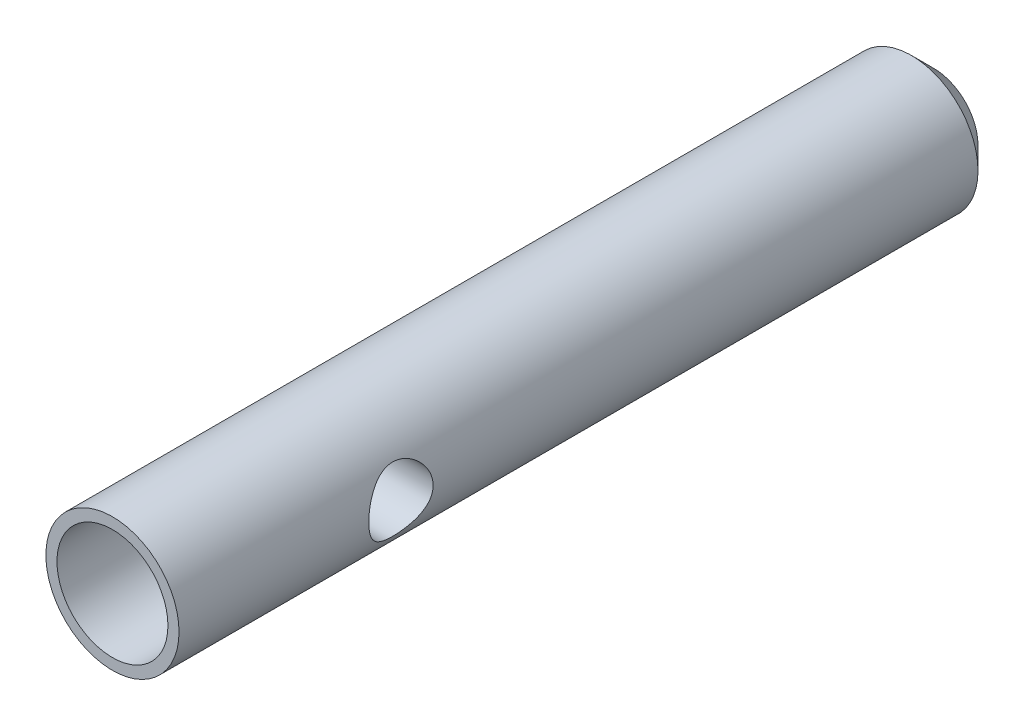
ISO-10303-21;
HEADER;
FILE_DESCRIPTION(('STEP AP214'),'2;1');
FILE_NAME('part.step','',(''),(''),'','','');
FILE_SCHEMA(('AUTOMOTIVE_DESIGN { 1 0 10303 214 1 1 1 1 }'));
ENDSEC;
DATA;
#1=APPLICATION_CONTEXT('core data for automotive mechanical design processes');
#2=APPLICATION_PROTOCOL_DEFINITION('international standard','automotive_design',2000,#1);
#3=PRODUCT_CONTEXT('',#1,'mechanical');
#4=PRODUCT('Part','Part','',(#3));
#5=PRODUCT_RELATED_PRODUCT_CATEGORY('part','',(#4));
#6=PRODUCT_DEFINITION_FORMATION('','',#4);
#7=PRODUCT_DEFINITION_CONTEXT('part definition',#1,'design');
#8=PRODUCT_DEFINITION('design','',#6,#7);
#9=PRODUCT_DEFINITION_SHAPE('','',#8);
#10=(LENGTH_UNIT() NAMED_UNIT(*) SI_UNIT(.MILLI.,.METRE.));
#11=(NAMED_UNIT(*) PLANE_ANGLE_UNIT() SI_UNIT($,.RADIAN.));
#12=(NAMED_UNIT(*) SI_UNIT($,.STERADIAN.) SOLID_ANGLE_UNIT());
#13=UNCERTAINTY_MEASURE_WITH_UNIT(LENGTH_MEASURE(1.E-05),#10,'distance_accuracy_value','');
#14=(GEOMETRIC_REPRESENTATION_CONTEXT(3) GLOBAL_UNCERTAINTY_ASSIGNED_CONTEXT((#13)) GLOBAL_UNIT_ASSIGNED_CONTEXT((#10,
#11,#12)) REPRESENTATION_CONTEXT('',''));
#15=CARTESIAN_POINT('',(0.,0.,0.));
#16=DIRECTION('',(0.,0.,1.));
#17=DIRECTION('',(1.,0.,0.));
#18=AXIS2_PLACEMENT_3D('',#15,#16,#17);
#19=CARTESIAN_POINT('',(0.,0.,37.));
#20=DIRECTION('',(0.,0.,-1.));
#21=DIRECTION('',(-1.,0.,0.));
#22=AXIS2_PLACEMENT_3D('',#19,#20,#21);
#23=CYLINDRICAL_SURFACE('',#22,3.);
#24=CARTESIAN_POINT('',(-3.,0.,25.55));
#25=CARTESIAN_POINT('',(-2.99999612081298,0.0765307274979416,25.5500045405193));
#26=CARTESIAN_POINT('',(-2.99703967394009,0.153161642735378,25.5560945879909));
#27=CARTESIAN_POINT('',(-2.98550501152449,0.304177604644465,25.5801943768202));
#28=CARTESIAN_POINT('',(-2.97691520396142,0.378557688801597,25.5982286972059));
#29=CARTESIAN_POINT('',(-2.9550169031266,0.52265346658165,25.6453572298512));
#30=CARTESIAN_POINT('',(-2.94172634014956,0.592385703895517,25.6744094460817));
#31=CARTESIAN_POINT('',(-2.91166102341307,0.725892100939563,25.7425412652125));
#32=CARTESIAN_POINT('',(-2.89488669768938,0.789666991230455,25.7816196363786));
#33=CARTESIAN_POINT('',(-2.85828185236896,0.913584245144568,25.8712643449592));
#34=CARTESIAN_POINT('',(-2.83833092337698,0.973305533119433,25.9223628970886));
#35=CARTESIAN_POINT('',(-2.79803945446581,1.0837139061515,26.0334573078884));
#36=CARTESIAN_POINT('',(-2.77769864962032,1.13439458820743,26.0934594178325));
#37=CARTESIAN_POINT('',(-2.73727073702847,1.22889240144532,26.2257950833783));
#38=CARTESIAN_POINT('',(-2.7173048647613,1.27196367592979,26.2987025278169));
#39=CARTESIAN_POINT('',(-2.68188338301647,1.34505108316872,26.4518040681357));
#40=CARTESIAN_POINT('',(-2.66642471915123,1.37507606376593,26.5319931809142));
#41=CARTESIAN_POINT('',(-2.64311522038543,1.41934460077888,26.6926111652423));
#42=CARTESIAN_POINT('',(-2.63487517137381,1.43440239745371,26.7727564353587));
#43=CARTESIAN_POINT('',(-2.62587653771564,1.45081708073883,26.9348250536738));
#44=CARTESIAN_POINT('',(-2.625111392162,1.45218598245471,27.0167467793141));
#45=CARTESIAN_POINT('',(-2.63083206405466,1.44178396367734,27.1703772023389));
#46=CARTESIAN_POINT('',(-2.63653015218159,1.43144073903634,27.2422187611512));
#47=CARTESIAN_POINT('',(-2.65316520459532,1.40036487654895,27.3829827717398));
#48=CARTESIAN_POINT('',(-2.66410366451324,1.37962927258196,27.4519043840311));
#49=CARTESIAN_POINT('',(-2.69023571019652,1.32796190942694,27.5868222160692));
#50=CARTESIAN_POINT('',(-2.70552247128007,1.2968039127114,27.6527129076692));
#51=CARTESIAN_POINT('',(-2.73862686619464,1.22534556534202,27.7786368102176));
#52=CARTESIAN_POINT('',(-2.75644562509711,1.18504114577511,27.8386673971671));
#53=CARTESIAN_POINT('',(-2.79513932815918,1.0909059718213,27.9585904788013));
#54=CARTESIAN_POINT('',(-2.81612741275565,1.03604250149277,28.0176385665667));
#55=CARTESIAN_POINT('',(-2.85708426031966,0.917075343074329,28.1260336767916));
#56=CARTESIAN_POINT('',(-2.87705259314359,0.852967798611948,28.1753766301267));
#57=CARTESIAN_POINT('',(-2.91471885551593,0.714000963992316,28.2648322378198));
#58=CARTESIAN_POINT('',(-2.93229107655916,0.638809950962981,28.3044867153606));
#59=CARTESIAN_POINT('',(-2.96214084082005,0.48175794107364,28.3702707725635));
#60=CARTESIAN_POINT('',(-2.97442232399267,0.39990196174367,28.3964104194871));
#61=CARTESIAN_POINT('',(-2.99149074518219,0.238788194513551,28.4323915821561));
#62=CARTESIAN_POINT('',(-2.99679351595986,0.159836780687537,28.4433584162994));
#63=CARTESIAN_POINT('',(-3.00104912370166,0.00104727212449658,28.4521754425244));
#64=CARTESIAN_POINT('',(-3.00000468355028,-0.0787904277354053,28.4500312590876));
#65=CARTESIAN_POINT('',(-2.99199281350272,-0.231041699195564,28.4333755874306));
#66=CARTESIAN_POINT('',(-2.98545325282241,-0.303578577529127,28.4197573111068));
#67=CARTESIAN_POINT('',(-2.96764024286646,-0.445205658807543,28.381906867184));
#68=CARTESIAN_POINT('',(-2.95636625577126,-0.514295469175788,28.3576734937218));
#69=CARTESIAN_POINT('',(-2.92969647172705,-0.649435554841712,28.2985898512282));
#70=CARTESIAN_POINT('',(-2.91418782119759,-0.715333824030334,28.2634446247957));
#71=CARTESIAN_POINT('',(-2.88057742037419,-0.840524717425349,28.1838608738915));
#72=CARTESIAN_POINT('',(-2.86247454151105,-0.899814446652079,28.1394183008984));
#73=CARTESIAN_POINT('',(-2.8234626779216,-1.01594845859459,28.0377127332999));
#74=CARTESIAN_POINT('',(-2.80244935025403,-1.07205124593029,27.9796413939304));
#75=CARTESIAN_POINT('',(-2.76128527675647,-1.17402466981411,27.8547912119017));
#76=CARTESIAN_POINT('',(-2.74113503731897,-1.2198893641481,27.7880073479128));
#77=CARTESIAN_POINT('',(-2.70323844091546,-1.301776942757,27.6441969618619));
#78=CARTESIAN_POINT('',(-2.68562066156143,-1.3373321590834,27.5668673658673));
#79=CARTESIAN_POINT('',(-2.65636772005657,-1.39454633181697,27.4061896500969));
#80=CARTESIAN_POINT('',(-2.64472537944019,-1.41622196994996,27.322848889697));
#81=CARTESIAN_POINT('',(-2.63011324701133,-1.44316248444081,27.1608710996561));
#82=CARTESIAN_POINT('',(-2.62643457503468,-1.44977184912152,27.0825224836815));
#83=CARTESIAN_POINT('',(-2.62619039680624,-1.45021623758756,26.925790225));
#84=CARTESIAN_POINT('',(-2.62962241574508,-1.44405570581539,26.847406603969));
#85=CARTESIAN_POINT('',(-2.64248035535494,-1.42037023201846,26.6997084358879));
#86=CARTESIAN_POINT('',(-2.65138127826905,-1.40383826193517,26.6301834859031));
#87=CARTESIAN_POINT('',(-2.6735971949962,-1.36104948582567,26.4949475272367));
#88=CARTESIAN_POINT('',(-2.6869135463913,-1.33478968855853,26.4292376988756));
#89=CARTESIAN_POINT('',(-2.71755592132651,-1.27130208969093,26.2986348909379));
#90=CARTESIAN_POINT('',(-2.73509104726921,-1.23345653697834,26.234092613847));
#91=CARTESIAN_POINT('',(-2.77180093726383,-1.14858894319866,26.1118640567804));
#92=CARTESIAN_POINT('',(-2.79097651389737,-1.10156233942563,26.0541812087646));
#93=CARTESIAN_POINT('',(-2.83134850762111,-0.993550269121284,25.9406828543666));
#94=CARTESIAN_POINT('',(-2.85253372552738,-0.931595972289931,25.8857804055507));
#95=CARTESIAN_POINT('',(-2.89255523527256,-0.798708288939405,25.7869793488573));
#96=CARTESIAN_POINT('',(-2.91139034591478,-0.727770422956243,25.7430862633325));
#97=CARTESIAN_POINT('',(-2.94467865113621,-0.578543437348614,25.667793403571));
#98=CARTESIAN_POINT('',(-2.95913047560339,-0.500252029174533,25.6363975347141));
#99=CARTESIAN_POINT('',(-2.98192539561231,-0.338708874975766,25.5876080840824));
#100=CARTESIAN_POINT('',(-2.99028627815326,-0.25547234610191,25.5701737164844));
#101=CARTESIAN_POINT('',(-2.99673174492225,-0.142893528745381,25.5567726387636));
#102=CARTESIAN_POINT('',(-2.997954546114,-0.114392467424232,25.5542360394183));
#103=CARTESIAN_POINT('',(-2.99958940972665,-0.0572656164332232,25.5508488491782));
#104=CARTESIAN_POINT('',(-3.00000145169445,-0.0286398236350072,25.5499983008175));
#105=CARTESIAN_POINT('',(-3.,0.,25.55));
#106=B_SPLINE_CURVE_WITH_KNOTS('',3,(#24,#25,#26,#27,#28,#29,#30,#31,#32,#33,#34,#35,#36,#37,
#38,#39,#40,#41,#42,#43,#44,#45,#46,#47,#48,#49,#50,#51,#52,#53,#54,#55,#56,#57,#58,#59,#60,#61,
#62,#63,#64,#65,#66,#67,#68,#69,#70,#71,#72,#73,#74,#75,#76,#77,#78,#79,#80,#81,#82,#83,#84,#85,
#86,#87,#88,#89,#90,#91,#92,#93,#94,#95,#96,#97,#98,#99,#100,#101,#102,#103,#104,#105),
.UNSPECIFIED.,.T.,.F.,(4,2,2,2,2,2,2,2,2,2,2,2,2,2,2,2,2,2,2,2,2,2,2,2,2,2,2,2,2,2,2,2,2,2,2,2,
2,2,2,2,4),(0.,0.22947557086318,0.459424831854174,0.688506282141685,0.91755960275651,
1.15981165811999,1.40223461290408,1.66192237223259,1.92143373845101,2.16589509779607,
2.4101418680794,2.62754281740569,2.84500585116379,3.06753398921646,3.29016131673734,
3.53893772322278,3.7878182142308,4.04684255861719,4.30567367553667,4.54403791097849,
4.78229989797434,5.00356397823134,5.22485320036184,5.45273911197755,5.68072446364084,
5.9299339676436,6.17928773952589,6.43862695604369,6.69765388739102,6.9324706888598,
7.16720577826903,7.38231982597292,7.5975000747688,7.82711979689807,8.05685392494063,
8.31201128566552,8.56729637980937,8.82266118802034,9.0772772478384,9.16315091326922,
9.2490267450159),.UNSPECIFIED.);
#107=CARTESIAN_POINT('',(-3.,0.,25.55));
#108=VERTEX_POINT('',#107);
#109=EDGE_CURVE('E10',#108,#108,#106,.T.);
#110=ORIENTED_EDGE('',*,*,#109,.T.);
#111=EDGE_LOOP('',(#110));
#112=FACE_BOUND('',#111,.T.);
#113=CARTESIAN_POINT('',(3.,0.,25.55));
#114=CARTESIAN_POINT('',(2.99999612081298,-0.0765307274979416,25.5500045405193));
#115=CARTESIAN_POINT('',(2.99703967394009,-0.153161642735378,25.5560945879909));
#116=CARTESIAN_POINT('',(2.98550501152449,-0.304177604644465,25.5801943768202));
#117=CARTESIAN_POINT('',(2.97691520396142,-0.378557688801597,25.5982286972059));
#118=CARTESIAN_POINT('',(2.9550169031266,-0.522653466581649,25.6453572298512));
#119=CARTESIAN_POINT('',(2.94172634014957,-0.592385703895515,25.6744094460817));
#120=CARTESIAN_POINT('',(2.91166102341307,-0.725892100939561,25.7425412652125));
#121=CARTESIAN_POINT('',(2.89488669768938,-0.789666991230454,25.7816196363786));
#122=CARTESIAN_POINT('',(2.85828185236896,-0.913584245144567,25.8712643449592));
#123=CARTESIAN_POINT('',(2.83833092337698,-0.973305533119432,25.9223628970886));
#124=CARTESIAN_POINT('',(2.79803945446581,-1.0837139061515,26.0334573078884));
#125=CARTESIAN_POINT('',(2.77769864962032,-1.13439458820743,26.0934594178325));
#126=CARTESIAN_POINT('',(2.73727073702847,-1.22889240144532,26.2257950833783));
#127=CARTESIAN_POINT('',(2.7173048647613,-1.27196367592979,26.2987025278169));
#128=CARTESIAN_POINT('',(2.68188338301647,-1.34505108316872,26.4518040681357));
#129=CARTESIAN_POINT('',(2.66642471915123,-1.37507606376593,26.5319931809142));
#130=CARTESIAN_POINT('',(2.64311522038543,-1.41934460077888,26.6926111652423));
#131=CARTESIAN_POINT('',(2.63487517137381,-1.43440239745371,26.7727564353587));
#132=CARTESIAN_POINT('',(2.62587653771564,-1.45081708073883,26.9348250536738));
#133=CARTESIAN_POINT('',(2.625111392162,-1.45218598245471,27.0167467793141));
#134=CARTESIAN_POINT('',(2.63083206405466,-1.44178396367734,27.1703772023389));
#135=CARTESIAN_POINT('',(2.63653015218159,-1.43144073903634,27.2422187611512));
#136=CARTESIAN_POINT('',(2.65316520459532,-1.40036487654895,27.3829827717398));
#137=CARTESIAN_POINT('',(2.66410366451324,-1.37962927258196,27.4519043840311));
#138=CARTESIAN_POINT('',(2.69023571019652,-1.32796190942694,27.5868222160692));
#139=CARTESIAN_POINT('',(2.70552247128007,-1.2968039127114,27.6527129076692));
#140=CARTESIAN_POINT('',(2.73862686619464,-1.22534556534202,27.7786368102176));
#141=CARTESIAN_POINT('',(2.75644562509711,-1.18504114577511,27.8386673971671));
#142=CARTESIAN_POINT('',(2.79513932815918,-1.0909059718213,27.9585904788013));
#143=CARTESIAN_POINT('',(2.81612741275565,-1.03604250149277,28.0176385665667));
#144=CARTESIAN_POINT('',(2.85708426031966,-0.917075343074328,28.1260336767916));
#145=CARTESIAN_POINT('',(2.87705259314359,-0.852967798611948,28.1753766301267));
#146=CARTESIAN_POINT('',(2.91471885551593,-0.714000963992316,28.2648322378198));
#147=CARTESIAN_POINT('',(2.93229107655916,-0.638809950962981,28.3044867153606));
#148=CARTESIAN_POINT('',(2.96214084082005,-0.48175794107364,28.3702707725635));
#149=CARTESIAN_POINT('',(2.97442232399267,-0.39990196174367,28.3964104194871));
#150=CARTESIAN_POINT('',(2.99149074518219,-0.238788194513552,28.4323915821561));
#151=CARTESIAN_POINT('',(2.99679351595986,-0.159836780687537,28.4433584162994));
#152=CARTESIAN_POINT('',(3.00104912370166,-0.00104727212449696,28.4521754425244));
#153=CARTESIAN_POINT('',(3.00000468355028,0.078790427735405,28.4500312590876));
#154=CARTESIAN_POINT('',(2.99199281350272,0.231041699195563,28.4333755874306));
#155=CARTESIAN_POINT('',(2.98545325282241,0.303578577529127,28.4197573111068));
#156=CARTESIAN_POINT('',(2.96764024286646,0.445205658807543,28.381906867184));
#157=CARTESIAN_POINT('',(2.95636625577126,0.514295469175788,28.3576734937218));
#158=CARTESIAN_POINT('',(2.92969647172705,0.649435554841712,28.2985898512282));
#159=CARTESIAN_POINT('',(2.91418782119759,0.715333824030334,28.2634446247957));
#160=CARTESIAN_POINT('',(2.88057742037419,0.840524717425349,28.1838608738915));
#161=CARTESIAN_POINT('',(2.86247454151105,0.899814446652079,28.1394183008984));
#162=CARTESIAN_POINT('',(2.8234626779216,1.01594845859459,28.0377127332999));
#163=CARTESIAN_POINT('',(2.80244935025403,1.07205124593029,27.9796413939304));
#164=CARTESIAN_POINT('',(2.76128527675647,1.17402466981411,27.8547912119017));
#165=CARTESIAN_POINT('',(2.74113503731897,1.2198893641481,27.7880073479128));
#166=CARTESIAN_POINT('',(2.70323844091546,1.301776942757,27.6441969618619));
#167=CARTESIAN_POINT('',(2.68562066156143,1.3373321590834,27.5668673658673));
#168=CARTESIAN_POINT('',(2.65636772005657,1.39454633181697,27.4061896500969));
#169=CARTESIAN_POINT('',(2.64472537944019,1.41622196994996,27.322848889697));
#170=CARTESIAN_POINT('',(2.63011324701133,1.44316248444081,27.1608710996561));
#171=CARTESIAN_POINT('',(2.62643457503468,1.44977184912152,27.0825224836815));
#172=CARTESIAN_POINT('',(2.62619039680624,1.45021623758756,26.925790225));
#173=CARTESIAN_POINT('',(2.62962241574508,1.44405570581539,26.847406603969));
#174=CARTESIAN_POINT('',(2.64248035535494,1.42037023201846,26.6997084358879));
#175=CARTESIAN_POINT('',(2.65138127826905,1.40383826193517,26.6301834859031));
#176=CARTESIAN_POINT('',(2.6735971949962,1.36104948582567,26.4949475272367));
#177=CARTESIAN_POINT('',(2.6869135463913,1.33478968855853,26.4292376988756));
#178=CARTESIAN_POINT('',(2.71755592132651,1.27130208969093,26.2986348909379));
#179=CARTESIAN_POINT('',(2.73509104726921,1.23345653697834,26.234092613847));
#180=CARTESIAN_POINT('',(2.77180093726383,1.14858894319866,26.1118640567804));
#181=CARTESIAN_POINT('',(2.79097651389737,1.10156233942563,26.0541812087646));
#182=CARTESIAN_POINT('',(2.83134850762111,0.993550269121284,25.9406828543666));
#183=CARTESIAN_POINT('',(2.85253372552738,0.931595972289931,25.8857804055507));
#184=CARTESIAN_POINT('',(2.89255523527256,0.798708288939405,25.7869793488573));
#185=CARTESIAN_POINT('',(2.91139034591478,0.727770422956243,25.7430862633325));
#186=CARTESIAN_POINT('',(2.94467865113621,0.578543437348614,25.667793403571));
#187=CARTESIAN_POINT('',(2.95913047560339,0.500252029174533,25.6363975347141));
#188=CARTESIAN_POINT('',(2.98192539561231,0.338708874975766,25.5876080840824));
#189=CARTESIAN_POINT('',(2.99028627815326,0.25547234610191,25.5701737164844));
#190=CARTESIAN_POINT('',(2.99673174492225,0.142893528745381,25.5567726387636));
#191=CARTESIAN_POINT('',(2.997954546114,0.114392467424232,25.5542360394183));
#192=CARTESIAN_POINT('',(2.99958940972665,0.0572656164332232,25.5508488491782));
#193=CARTESIAN_POINT('',(3.00000145169445,0.0286398236350072,25.5499983008175));
#194=CARTESIAN_POINT('',(3.,0.,25.55));
#195=B_SPLINE_CURVE_WITH_KNOTS('',3,(#113,#114,#115,#116,#117,#118,#119,#120,#121,#122,#123,
#124,#125,#126,#127,#128,#129,#130,#131,#132,#133,#134,#135,#136,#137,#138,#139,#140,#141,#142,
#143,#144,#145,#146,#147,#148,#149,#150,#151,#152,#153,#154,#155,#156,#157,#158,#159,#160,#161,
#162,#163,#164,#165,#166,#167,#168,#169,#170,#171,#172,#173,#174,#175,#176,#177,#178,#179,#180,
#181,#182,#183,#184,#185,#186,#187,#188,#189,#190,#191,#192,#193,#194),.UNSPECIFIED.,.T.,.F.,(4,
2,2,2,2,2,2,2,2,2,2,2,2,2,2,2,2,2,2,2,2,2,2,2,2,2,2,2,2,2,2,2,2,2,2,2,2,2,2,2,4),(0.,
0.22947557086318,0.459424831854174,0.68850628214168,0.91755960275651,1.15981165811999,
1.40223461290408,1.66192237223259,1.92143373845101,2.16589509779607,2.4101418680794,
2.62754281740569,2.84500585116379,3.06753398921646,3.29016131673734,3.53893772322278,
3.7878182142308,4.0468425586172,4.30567367553667,4.54403791097849,4.78229989797434,
5.00356397823134,5.22485320036184,5.45273911197755,5.68072446364084,5.9299339676436,
6.17928773952589,6.43862695604369,6.69765388739102,6.9324706888598,7.16720577826903,
7.38231982597292,7.5975000747688,7.82711979689807,8.05685392494063,8.31201128566552,
8.56729637980937,8.82266118802034,9.0772772478384,9.16315091326922,9.2490267450159),.UNSPECIFIED.);
#196=CARTESIAN_POINT('',(3.,0.,25.55));
#197=VERTEX_POINT('',#196);
#198=EDGE_CURVE('E44',#197,#197,#195,.T.);
#199=ORIENTED_EDGE('',*,*,#198,.T.);
#200=EDGE_LOOP('',(#199));
#201=FACE_BOUND('',#200,.T.);
#202=CARTESIAN_POINT('',(0.,0.,0.999999999999994));
#203=DIRECTION('',(0.,0.,1.));
#204=DIRECTION('',(1.,0.,0.));
#205=AXIS2_PLACEMENT_3D('',#202,#203,#204);
#206=CIRCLE('',#205,3.);
#207=CARTESIAN_POINT('',(3.,0.,0.999999999999994));
#208=VERTEX_POINT('',#207);
#209=EDGE_CURVE('E52',#208,#208,#206,.T.);
#210=ORIENTED_EDGE('',*,*,#209,.T.);
#211=EDGE_LOOP('',(#210));
#212=FACE_BOUND('',#211,.T.);
#213=CARTESIAN_POINT('',(0.,0.,37.));
#214=DIRECTION('',(0.,0.,1.));
#215=DIRECTION('',(1.,0.,0.));
#216=AXIS2_PLACEMENT_3D('',#213,#214,#215);
#217=CIRCLE('',#216,3.);
#218=CARTESIAN_POINT('',(3.,0.,37.));
#219=VERTEX_POINT('',#218);
#220=EDGE_CURVE('E90',#219,#219,#217,.T.);
#221=ORIENTED_EDGE('',*,*,#220,.F.);
#222=EDGE_LOOP('',(#221));
#223=FACE_BOUND('',#222,.T.);
#224=ADVANCED_FACE('F34',(#112,#201,#212,#223),#23,.T.);
#225=CARTESIAN_POINT('',(0.,0.,37.));
#226=DIRECTION('',(0.,0.,1.));
#227=DIRECTION('',(1.,0.,0.));
#228=AXIS2_PLACEMENT_3D('',#225,#226,#227);
#229=PLANE('',#228);
#230=CARTESIAN_POINT('',(0.,0.,37.));
#231=DIRECTION('',(0.,0.,1.));
#232=DIRECTION('',(1.,0.,0.));
#233=AXIS2_PLACEMENT_3D('',#230,#231,#232);
#234=CIRCLE('',#233,2.5);
#235=CARTESIAN_POINT('',(2.5,0.,37.));
#236=VERTEX_POINT('',#235);
#237=EDGE_CURVE('E95',#236,#236,#234,.T.);
#238=ORIENTED_EDGE('',*,*,#237,.F.);
#239=EDGE_LOOP('',(#238));
#240=FACE_BOUND('',#239,.T.);
#241=ORIENTED_EDGE('',*,*,#220,.T.);
#242=EDGE_LOOP('',(#241));
#243=FACE_BOUND('',#242,.T.);
#244=ADVANCED_FACE('F74',(#240,#243),#229,.T.);
#245=CARTESIAN_POINT('',(0.,0.,0.));
#246=DIRECTION('',(0.,0.,1.));
#247=DIRECTION('',(1.,0.,0.));
#248=AXIS2_PLACEMENT_3D('',#245,#246,#247);
#249=PLANE('',#248);
#250=CARTESIAN_POINT('',(0.,0.,0.));
#251=DIRECTION('',(0.,0.,1.));
#252=DIRECTION('',(1.,0.,0.));
#253=AXIS2_PLACEMENT_3D('',#250,#251,#252);
#254=CIRCLE('',#253,2.);
#255=CARTESIAN_POINT('',(2.,0.,0.));
#256=VERTEX_POINT('',#255);
#257=EDGE_CURVE('E48',#256,#256,#254,.F.);
#258=ORIENTED_EDGE('',*,*,#257,.T.);
#259=EDGE_LOOP('',(#258));
#260=FACE_BOUND('',#259,.T.);
#261=ADVANCED_FACE('F72',(#260),#249,.F.);
#262=CARTESIAN_POINT('',(0.,0.,31.));
#263=DIRECTION('',(0.,0.,1.));
#264=DIRECTION('',(1.,0.,0.));
#265=AXIS2_PLACEMENT_3D('',#262,#263,#264);
#266=CYLINDRICAL_SURFACE('',#265,2.5);
#267=CARTESIAN_POINT('',(0.,0.,31.));
#268=DIRECTION('',(0.,0.,1.));
#269=DIRECTION('',(1.,0.,0.));
#270=AXIS2_PLACEMENT_3D('',#267,#268,#269);
#271=CIRCLE('',#270,2.5);
#272=CARTESIAN_POINT('',(2.5,0.,31.));
#273=VERTEX_POINT('',#272);
#274=EDGE_CURVE('E92',#273,#273,#271,.T.);
#275=ORIENTED_EDGE('',*,*,#274,.F.);
#276=EDGE_LOOP('',(#275));
#277=FACE_BOUND('',#276,.T.);
#278=ORIENTED_EDGE('',*,*,#237,.T.);
#279=EDGE_LOOP('',(#278));
#280=FACE_BOUND('',#279,.T.);
#281=ADVANCED_FACE('F68',(#277,#280),#266,.F.);
#282=CARTESIAN_POINT('',(0.,0.,31.));
#283=DIRECTION('',(0.,0.,1.));
#284=DIRECTION('',(1.,0.,0.));
#285=AXIS2_PLACEMENT_3D('',#282,#283,#284);
#286=PLANE('',#285);
#287=ORIENTED_EDGE('',*,*,#274,.T.);
#288=EDGE_LOOP('',(#287));
#289=FACE_BOUND('',#288,.T.);
#290=ADVANCED_FACE('F64',(#289),#286,.T.);
#291=CARTESIAN_POINT('',(0.,0.,0.999999999999994));
#292=DIRECTION('',(0.,0.,1.));
#293=DIRECTION('',(1.,0.,0.));
#294=AXIS2_PLACEMENT_3D('',#291,#292,#293);
#295=CONICAL_SURFACE('',#294,3.,0.78539816339745);
#296=ORIENTED_EDGE('',*,*,#257,.F.);
#297=EDGE_LOOP('',(#296));
#298=FACE_BOUND('',#297,.T.);
#299=ORIENTED_EDGE('',*,*,#209,.F.);
#300=EDGE_LOOP('',(#299));
#301=FACE_BOUND('',#300,.T.);
#302=ADVANCED_FACE('F36',(#298,#301),#295,.T.);
#303=CARTESIAN_POINT('',(3.,0.,27.));
#304=DIRECTION('',(1.,0.,0.));
#305=DIRECTION('',(0.,0.,-1.));
#306=AXIS2_PLACEMENT_3D('',#303,#304,#305);
#307=CYLINDRICAL_SURFACE('',#306,1.44999999999999);
#308=ORIENTED_EDGE('',*,*,#198,.F.);
#309=EDGE_LOOP('',(#308));
#310=FACE_BOUND('',#309,.T.);
#311=ORIENTED_EDGE('',*,*,#109,.F.);
#312=EDGE_LOOP('',(#311));
#313=FACE_BOUND('',#312,.T.);
#314=ADVANCED_FACE('F59',(#310,#313),#307,.F.);
#315=CLOSED_SHELL('',(#224,#244,#261,#281,#290,#302,#314));
#316=MANIFOLD_SOLID_BREP('B2',#315);
#317=ADVANCED_BREP_SHAPE_REPRESENTATION('',(#18,#316),#14);
#318=SHAPE_DEFINITION_REPRESENTATION(#9,#317);
ENDSEC;
END-ISO-10303-21;
